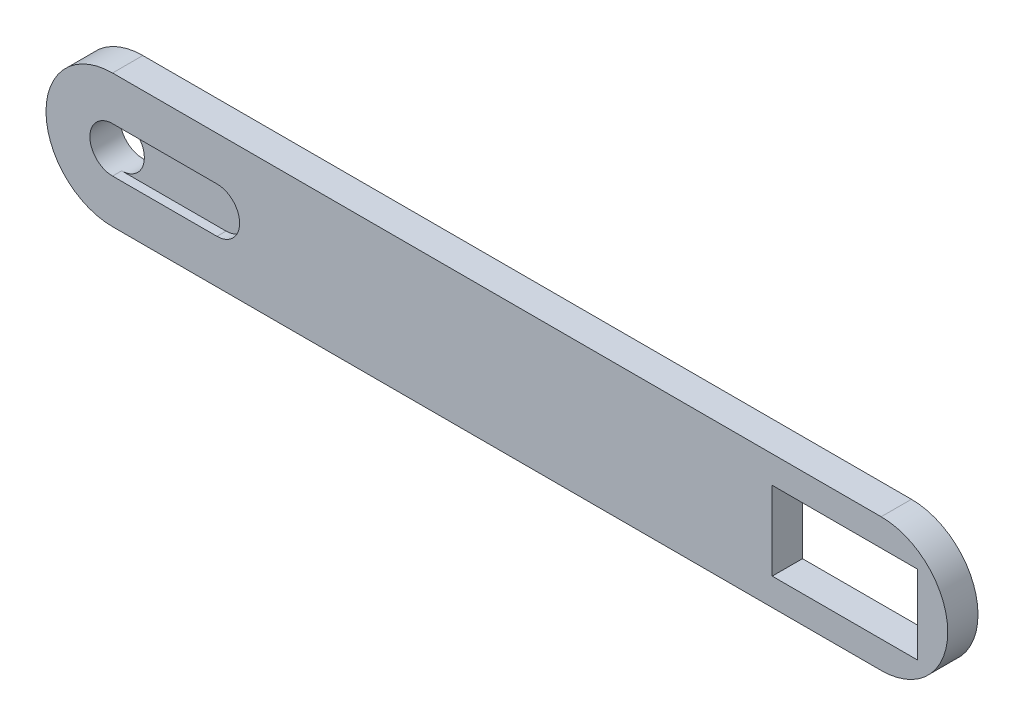
ISO-10303-21;
HEADER;
FILE_DESCRIPTION(('STEP AP214'),'2;1');
FILE_NAME('part.step','',(''),(''),'','','');
FILE_SCHEMA(('AUTOMOTIVE_DESIGN { 1 0 10303 214 1 1 1 1 }'));
ENDSEC;
DATA;
#1=APPLICATION_CONTEXT('core data for automotive mechanical design processes');
#2=APPLICATION_PROTOCOL_DEFINITION('international standard','automotive_design',2000,#1);
#3=PRODUCT_CONTEXT('',#1,'mechanical');
#4=PRODUCT('Part','Part','',(#3));
#5=PRODUCT_RELATED_PRODUCT_CATEGORY('part','',(#4));
#6=PRODUCT_DEFINITION_FORMATION('','',#4);
#7=PRODUCT_DEFINITION_CONTEXT('part definition',#1,'design');
#8=PRODUCT_DEFINITION('design','',#6,#7);
#9=PRODUCT_DEFINITION_SHAPE('','',#8);
#10=(LENGTH_UNIT() NAMED_UNIT(*) SI_UNIT(.MILLI.,.METRE.));
#11=(NAMED_UNIT(*) PLANE_ANGLE_UNIT() SI_UNIT($,.RADIAN.));
#12=(NAMED_UNIT(*) SI_UNIT($,.STERADIAN.) SOLID_ANGLE_UNIT());
#13=UNCERTAINTY_MEASURE_WITH_UNIT(LENGTH_MEASURE(1.E-05),#10,'distance_accuracy_value','');
#14=(GEOMETRIC_REPRESENTATION_CONTEXT(3) GLOBAL_UNCERTAINTY_ASSIGNED_CONTEXT((#13)) GLOBAL_UNIT_ASSIGNED_CONTEXT((#10,
#11,#12)) REPRESENTATION_CONTEXT('',''));
#15=CARTESIAN_POINT('',(0.,0.,0.));
#16=DIRECTION('',(0.,0.,1.));
#17=DIRECTION('',(1.,0.,0.));
#18=AXIS2_PLACEMENT_3D('',#15,#16,#17);
#19=CARTESIAN_POINT('',(0.,11.,5.));
#20=DIRECTION('',(0.,0.,-1.));
#21=DIRECTION('',(-1.,0.,0.));
#22=AXIS2_PLACEMENT_3D('',#19,#20,#21);
#23=CYLINDRICAL_SURFACE('',#22,3.75);
#24=CARTESIAN_POINT('',(0.,11.,0.));
#25=DIRECTION('',(0.,0.,1.));
#26=DIRECTION('',(1.,0.,0.));
#27=AXIS2_PLACEMENT_3D('',#24,#25,#26);
#28=CIRCLE('',#27,3.75);
#29=CARTESIAN_POINT('',(3.75,11.,0.));
#30=VERTEX_POINT('',#29);
#31=EDGE_CURVE('E141',#30,#30,#28,.T.);
#32=ORIENTED_EDGE('',*,*,#31,.F.);
#33=EDGE_LOOP('',(#32));
#34=FACE_BOUND('',#33,.T.);
#35=CARTESIAN_POINT('',(0.,11.,5.));
#36=DIRECTION('',(0.,0.,1.));
#37=DIRECTION('',(1.,0.,0.));
#38=AXIS2_PLACEMENT_3D('',#35,#36,#37);
#39=CIRCLE('',#38,3.75);
#40=CARTESIAN_POINT('',(0.,14.75,5.));
#41=VERTEX_POINT('',#40);
#42=CARTESIAN_POINT('',(0.,7.24999999999999,5.));
#43=VERTEX_POINT('',#42);
#44=EDGE_CURVE('E164',#41,#43,#39,.T.);
#45=ORIENTED_EDGE('',*,*,#44,.T.);
#46=DIRECTION('',(0.,0.,1.));
#47=VECTOR('',#46,1.);
#48=CARTESIAN_POINT('',(0.,7.24999999999999,3.5));
#49=LINE('',#48,#47);
#50=CARTESIAN_POINT('',(0.,7.24999999999999,3.5));
#51=VERTEX_POINT('',#50);
#52=EDGE_CURVE('E218',#51,#43,#49,.T.);
#53=ORIENTED_EDGE('',*,*,#52,.F.);
#54=CARTESIAN_POINT('',(0.,11.,3.5));
#55=DIRECTION('',(0.,0.,-1.));
#56=DIRECTION('',(-1.,0.,0.));
#57=AXIS2_PLACEMENT_3D('',#54,#55,#56);
#58=CIRCLE('',#57,3.75);
#59=CARTESIAN_POINT('',(0.,14.75,3.5));
#60=VERTEX_POINT('',#59);
#61=EDGE_CURVE('E354',#60,#51,#58,.T.);
#62=ORIENTED_EDGE('',*,*,#61,.F.);
#63=DIRECTION('',(0.,0.,1.));
#64=VECTOR('',#63,1.);
#65=CARTESIAN_POINT('',(0.,14.75,3.5));
#66=LINE('',#65,#64);
#67=EDGE_CURVE('E221',#60,#41,#66,.T.);
#68=ORIENTED_EDGE('',*,*,#67,.T.);
#69=EDGE_LOOP('',(#45,#53,#62,#68));
#70=FACE_BOUND('',#69,.T.);
#71=ADVANCED_FACE('F34',(#34,#70),#23,.F.);
#72=CARTESIAN_POINT('',(0.,22.,5.));
#73=DIRECTION('',(0.,-1.,0.));
#74=DIRECTION('',(1.,0.,0.));
#75=AXIS2_PLACEMENT_3D('',#72,#73,#74);
#76=PLANE('',#75);
#77=DIRECTION('',(-1.,0.,0.));
#78=VECTOR('',#77,1.);
#79=CARTESIAN_POINT('',(0.,22.,0.));
#80=LINE('',#79,#78);
#81=CARTESIAN_POINT('',(127.,22.,0.));
#82=VERTEX_POINT('',#81);
#83=CARTESIAN_POINT('',(0.,22.,0.));
#84=VERTEX_POINT('',#83);
#85=EDGE_CURVE('E157',#82,#84,#80,.T.);
#86=ORIENTED_EDGE('',*,*,#85,.T.);
#87=DIRECTION('',(0.,0.,-1.));
#88=VECTOR('',#87,1.);
#89=CARTESIAN_POINT('',(0.,22.,5.));
#90=LINE('',#89,#88);
#91=CARTESIAN_POINT('',(0.,22.,5.));
#92=VERTEX_POINT('',#91);
#93=EDGE_CURVE('E11',#92,#84,#90,.T.);
#94=ORIENTED_EDGE('',*,*,#93,.F.);
#95=DIRECTION('',(-1.,0.,0.));
#96=VECTOR('',#95,1.);
#97=CARTESIAN_POINT('',(0.,22.,5.));
#98=LINE('',#97,#96);
#99=CARTESIAN_POINT('',(127.,22.,5.));
#100=VERTEX_POINT('',#99);
#101=EDGE_CURVE('E124',#100,#92,#98,.T.);
#102=ORIENTED_EDGE('',*,*,#101,.F.);
#103=DIRECTION('',(0.,0.,-1.));
#104=VECTOR('',#103,1.);
#105=CARTESIAN_POINT('',(127.,22.,5.));
#106=LINE('',#105,#104);
#107=EDGE_CURVE('E165',#100,#82,#106,.T.);
#108=ORIENTED_EDGE('',*,*,#107,.T.);
#109=EDGE_LOOP('',(#86,#94,#102,#108));
#110=FACE_BOUND('',#109,.T.);
#111=ADVANCED_FACE('F201',(#110),#76,.F.);
#112=CARTESIAN_POINT('',(0.,11.,5.));
#113=DIRECTION('',(0.,0.,-1.));
#114=DIRECTION('',(-1.,0.,0.));
#115=AXIS2_PLACEMENT_3D('',#112,#113,#114);
#116=CYLINDRICAL_SURFACE('',#115,11.);
#117=CARTESIAN_POINT('',(0.,11.,0.));
#118=DIRECTION('',(0.,0.,1.));
#119=DIRECTION('',(1.,0.,0.));
#120=AXIS2_PLACEMENT_3D('',#117,#118,#119);
#121=CIRCLE('',#120,11.);
#122=CARTESIAN_POINT('',(0.,0.,0.));
#123=VERTEX_POINT('',#122);
#124=EDGE_CURVE('E130',#84,#123,#121,.T.);
#125=ORIENTED_EDGE('',*,*,#124,.T.);
#126=DIRECTION('',(0.,0.,-1.));
#127=VECTOR('',#126,1.);
#128=CARTESIAN_POINT('',(0.,0.,5.));
#129=LINE('',#128,#127);
#130=CARTESIAN_POINT('',(0.,0.,5.));
#131=VERTEX_POINT('',#130);
#132=EDGE_CURVE('E42',#131,#123,#129,.T.);
#133=ORIENTED_EDGE('',*,*,#132,.F.);
#134=CARTESIAN_POINT('',(0.,11.,5.));
#135=DIRECTION('',(0.,0.,1.));
#136=DIRECTION('',(1.,0.,0.));
#137=AXIS2_PLACEMENT_3D('',#134,#135,#136);
#138=CIRCLE('',#137,11.);
#139=EDGE_CURVE('E117',#92,#131,#138,.T.);
#140=ORIENTED_EDGE('',*,*,#139,.F.);
#141=ORIENTED_EDGE('',*,*,#93,.T.);
#142=EDGE_LOOP('',(#125,#133,#140,#141));
#143=FACE_BOUND('',#142,.T.);
#144=ADVANCED_FACE('F129',(#143),#116,.T.);
#145=CARTESIAN_POINT('',(0.,0.,5.));
#146=DIRECTION('',(0.,1.,0.));
#147=DIRECTION('',(0.,0.,1.));
#148=AXIS2_PLACEMENT_3D('',#145,#146,#147);
#149=PLANE('',#148);
#150=DIRECTION('',(1.,0.,0.));
#151=VECTOR('',#150,1.);
#152=CARTESIAN_POINT('',(0.,0.,0.));
#153=LINE('',#152,#151);
#154=CARTESIAN_POINT('',(127.,0.,0.));
#155=VERTEX_POINT('',#154);
#156=EDGE_CURVE('E161',#123,#155,#153,.T.);
#157=ORIENTED_EDGE('',*,*,#156,.T.);
#158=DIRECTION('',(0.,0.,-1.));
#159=VECTOR('',#158,1.);
#160=CARTESIAN_POINT('',(127.,0.,5.));
#161=LINE('',#160,#159);
#162=CARTESIAN_POINT('',(127.,0.,5.));
#163=VERTEX_POINT('',#162);
#164=EDGE_CURVE('E133',#163,#155,#161,.T.);
#165=ORIENTED_EDGE('',*,*,#164,.F.);
#166=DIRECTION('',(1.,0.,0.));
#167=VECTOR('',#166,1.);
#168=CARTESIAN_POINT('',(0.,0.,5.));
#169=LINE('',#168,#167);
#170=EDGE_CURVE('E121',#131,#163,#169,.T.);
#171=ORIENTED_EDGE('',*,*,#170,.F.);
#172=ORIENTED_EDGE('',*,*,#132,.T.);
#173=EDGE_LOOP('',(#157,#165,#171,#172));
#174=FACE_BOUND('',#173,.T.);
#175=ADVANCED_FACE('F135',(#174),#149,.F.);
#176=CARTESIAN_POINT('',(0.,17.5,5.));
#177=DIRECTION('',(0.,1.,0.));
#178=DIRECTION('',(0.,0.,1.));
#179=AXIS2_PLACEMENT_3D('',#176,#177,#178);
#180=PLANE('',#179);
#181=DIRECTION('',(1.,0.,0.));
#182=VECTOR('',#181,1.);
#183=CARTESIAN_POINT('',(0.,17.5,0.));
#184=LINE('',#183,#182);
#185=CARTESIAN_POINT('',(109.,17.5,0.));
#186=VERTEX_POINT('',#185);
#187=CARTESIAN_POINT('',(133.,17.5,0.));
#188=VERTEX_POINT('',#187);
#189=EDGE_CURVE('E144',#186,#188,#184,.T.);
#190=ORIENTED_EDGE('',*,*,#189,.T.);
#191=DIRECTION('',(0.,0.,-1.));
#192=VECTOR('',#191,1.);
#193=CARTESIAN_POINT('',(133.,17.5,5.));
#194=LINE('',#193,#192);
#195=CARTESIAN_POINT('',(133.,17.5,5.));
#196=VERTEX_POINT('',#195);
#197=EDGE_CURVE('E37',#196,#188,#194,.T.);
#198=ORIENTED_EDGE('',*,*,#197,.F.);
#199=DIRECTION('',(1.,0.,0.));
#200=VECTOR('',#199,1.);
#201=CARTESIAN_POINT('',(0.,17.5,5.));
#202=LINE('',#201,#200);
#203=CARTESIAN_POINT('',(109.,17.5,5.));
#204=VERTEX_POINT('',#203);
#205=EDGE_CURVE('E225',#204,#196,#202,.T.);
#206=ORIENTED_EDGE('',*,*,#205,.F.);
#207=DIRECTION('',(0.,0.,-1.));
#208=VECTOR('',#207,1.);
#209=CARTESIAN_POINT('',(109.,17.5,5.));
#210=LINE('',#209,#208);
#211=EDGE_CURVE('E137',#204,#186,#210,.T.);
#212=ORIENTED_EDGE('',*,*,#211,.T.);
#213=EDGE_LOOP('',(#190,#198,#206,#212));
#214=FACE_BOUND('',#213,.T.);
#215=ADVANCED_FACE('F179',(#214),#180,.F.);
#216=CARTESIAN_POINT('',(133.,0.,5.));
#217=DIRECTION('',(1.,0.,0.));
#218=DIRECTION('',(0.,0.,-1.));
#219=AXIS2_PLACEMENT_3D('',#216,#217,#218);
#220=PLANE('',#219);
#221=DIRECTION('',(0.,-1.,0.));
#222=VECTOR('',#221,1.);
#223=CARTESIAN_POINT('',(133.,0.,0.));
#224=LINE('',#223,#222);
#225=CARTESIAN_POINT('',(133.,4.5,0.));
#226=VERTEX_POINT('',#225);
#227=EDGE_CURVE('E148',#188,#226,#224,.T.);
#228=ORIENTED_EDGE('',*,*,#227,.T.);
#229=DIRECTION('',(0.,0.,-1.));
#230=VECTOR('',#229,1.);
#231=CARTESIAN_POINT('',(133.,4.5,5.));
#232=LINE('',#231,#230);
#233=CARTESIAN_POINT('',(133.,4.5,5.));
#234=VERTEX_POINT('',#233);
#235=EDGE_CURVE('E170',#234,#226,#232,.T.);
#236=ORIENTED_EDGE('',*,*,#235,.F.);
#237=DIRECTION('',(0.,-1.,0.));
#238=VECTOR('',#237,1.);
#239=CARTESIAN_POINT('',(133.,0.,5.));
#240=LINE('',#239,#238);
#241=EDGE_CURVE('E101',#196,#234,#240,.T.);
#242=ORIENTED_EDGE('',*,*,#241,.F.);
#243=ORIENTED_EDGE('',*,*,#197,.T.);
#244=EDGE_LOOP('',(#228,#236,#242,#243));
#245=FACE_BOUND('',#244,.T.);
#246=ADVANCED_FACE('F175',(#245),#220,.F.);
#247=CARTESIAN_POINT('',(0.,4.5,5.));
#248=DIRECTION('',(0.,1.,0.));
#249=DIRECTION('',(0.,0.,1.));
#250=AXIS2_PLACEMENT_3D('',#247,#248,#249);
#251=PLANE('',#250);
#252=DIRECTION('',(1.,0.,0.));
#253=VECTOR('',#252,1.);
#254=CARTESIAN_POINT('',(0.,4.5,0.));
#255=LINE('',#254,#253);
#256=CARTESIAN_POINT('',(109.,4.5,0.));
#257=VERTEX_POINT('',#256);
#258=EDGE_CURVE('E151',#257,#226,#255,.T.);
#259=ORIENTED_EDGE('',*,*,#258,.F.);
#260=DIRECTION('',(0.,0.,-1.));
#261=VECTOR('',#260,1.);
#262=CARTESIAN_POINT('',(109.,4.5,5.));
#263=LINE('',#262,#261);
#264=CARTESIAN_POINT('',(109.,4.5,5.));
#265=VERTEX_POINT('',#264);
#266=EDGE_CURVE('E169',#265,#257,#263,.T.);
#267=ORIENTED_EDGE('',*,*,#266,.F.);
#268=DIRECTION('',(1.,0.,0.));
#269=VECTOR('',#268,1.);
#270=CARTESIAN_POINT('',(0.,4.5,5.));
#271=LINE('',#270,#269);
#272=EDGE_CURVE('E233',#265,#234,#271,.T.);
#273=ORIENTED_EDGE('',*,*,#272,.T.);
#274=ORIENTED_EDGE('',*,*,#235,.T.);
#275=EDGE_LOOP('',(#259,#267,#273,#274));
#276=FACE_BOUND('',#275,.T.);
#277=ADVANCED_FACE('F190',(#276),#251,.T.);
#278=CARTESIAN_POINT('',(109.,0.,5.));
#279=DIRECTION('',(1.,0.,0.));
#280=DIRECTION('',(0.,0.,-1.));
#281=AXIS2_PLACEMENT_3D('',#278,#279,#280);
#282=PLANE('',#281);
#283=DIRECTION('',(0.,-1.,0.));
#284=VECTOR('',#283,1.);
#285=CARTESIAN_POINT('',(109.,0.,0.));
#286=LINE('',#285,#284);
#287=EDGE_CURVE('E154',#186,#257,#286,.T.);
#288=ORIENTED_EDGE('',*,*,#287,.F.);
#289=ORIENTED_EDGE('',*,*,#211,.F.);
#290=DIRECTION('',(0.,-1.,0.));
#291=VECTOR('',#290,1.);
#292=CARTESIAN_POINT('',(109.,0.,5.));
#293=LINE('',#292,#291);
#294=EDGE_CURVE('E188',#204,#265,#293,.T.);
#295=ORIENTED_EDGE('',*,*,#294,.T.);
#296=ORIENTED_EDGE('',*,*,#266,.T.);
#297=EDGE_LOOP('',(#288,#289,#295,#296));
#298=FACE_BOUND('',#297,.T.);
#299=ADVANCED_FACE('F185',(#298),#282,.T.);
#300=CARTESIAN_POINT('',(127.,11.,5.));
#301=DIRECTION('',(0.,0.,-1.));
#302=DIRECTION('',(-1.,0.,0.));
#303=AXIS2_PLACEMENT_3D('',#300,#301,#302);
#304=CYLINDRICAL_SURFACE('',#303,11.);
#305=CARTESIAN_POINT('',(127.,11.,0.));
#306=DIRECTION('',(0.,0.,1.));
#307=DIRECTION('',(1.,0.,0.));
#308=AXIS2_PLACEMENT_3D('',#305,#306,#307);
#309=CIRCLE('',#308,11.);
#310=EDGE_CURVE('E92',#155,#82,#309,.T.);
#311=ORIENTED_EDGE('',*,*,#310,.T.);
#312=ORIENTED_EDGE('',*,*,#107,.F.);
#313=CARTESIAN_POINT('',(127.,11.,5.));
#314=DIRECTION('',(0.,0.,1.));
#315=DIRECTION('',(1.,0.,0.));
#316=AXIS2_PLACEMENT_3D('',#313,#314,#315);
#317=CIRCLE('',#316,11.);
#318=EDGE_CURVE('E59',#163,#100,#317,.T.);
#319=ORIENTED_EDGE('',*,*,#318,.F.);
#320=ORIENTED_EDGE('',*,*,#164,.T.);
#321=EDGE_LOOP('',(#311,#312,#319,#320));
#322=FACE_BOUND('',#321,.T.);
#323=ADVANCED_FACE('F197',(#322),#304,.T.);
#324=CARTESIAN_POINT('',(0.,0.,5.));
#325=DIRECTION('',(0.,0.,1.));
#326=DIRECTION('',(1.,0.,0.));
#327=AXIS2_PLACEMENT_3D('',#324,#325,#326);
#328=PLANE('',#327);
#329=DIRECTION('',(1.,0.,0.));
#330=VECTOR('',#329,1.);
#331=CARTESIAN_POINT('',(0.,7.24999999999999,5.));
#332=LINE('',#331,#330);
#333=CARTESIAN_POINT('',(17.25,7.24999999999999,5.));
#334=VERTEX_POINT('',#333);
#335=EDGE_CURVE('E352',#43,#334,#332,.T.);
#336=ORIENTED_EDGE('',*,*,#335,.F.);
#337=ORIENTED_EDGE('',*,*,#44,.F.);
#338=DIRECTION('',(-1.,0.,0.));
#339=VECTOR('',#338,1.);
#340=CARTESIAN_POINT('',(0.,14.75,5.));
#341=LINE('',#340,#339);
#342=CARTESIAN_POINT('',(17.25,14.75,5.));
#343=VERTEX_POINT('',#342);
#344=EDGE_CURVE('E357',#343,#41,#341,.T.);
#345=ORIENTED_EDGE('',*,*,#344,.F.);
#346=CARTESIAN_POINT('',(17.25,11.,5.));
#347=DIRECTION('',(0.,0.,1.));
#348=DIRECTION('',(-1.,0.,0.));
#349=AXIS2_PLACEMENT_3D('',#346,#347,#348);
#350=CIRCLE('',#349,3.75);
#351=EDGE_CURVE('E50',#334,#343,#350,.T.);
#352=ORIENTED_EDGE('',*,*,#351,.F.);
#353=EDGE_LOOP('',(#336,#337,#345,#352));
#354=FACE_BOUND('',#353,.T.);
#355=ORIENTED_EDGE('',*,*,#205,.T.);
#356=ORIENTED_EDGE('',*,*,#241,.T.);
#357=ORIENTED_EDGE('',*,*,#272,.F.);
#358=ORIENTED_EDGE('',*,*,#294,.F.);
#359=EDGE_LOOP('',(#355,#356,#357,#358));
#360=FACE_BOUND('',#359,.T.);
#361=ORIENTED_EDGE('',*,*,#101,.T.);
#362=ORIENTED_EDGE('',*,*,#139,.T.);
#363=ORIENTED_EDGE('',*,*,#170,.T.);
#364=ORIENTED_EDGE('',*,*,#318,.T.);
#365=EDGE_LOOP('',(#361,#362,#363,#364));
#366=FACE_BOUND('',#365,.T.);
#367=ADVANCED_FACE('F119',(#354,#360,#366),#328,.T.);
#368=CARTESIAN_POINT('',(0.,0.,0.));
#369=DIRECTION('',(0.,0.,1.));
#370=DIRECTION('',(1.,0.,0.));
#371=AXIS2_PLACEMENT_3D('',#368,#369,#370);
#372=PLANE('',#371);
#373=ORIENTED_EDGE('',*,*,#31,.T.);
#374=EDGE_LOOP('',(#373));
#375=FACE_BOUND('',#374,.T.);
#376=ORIENTED_EDGE('',*,*,#189,.F.);
#377=ORIENTED_EDGE('',*,*,#287,.T.);
#378=ORIENTED_EDGE('',*,*,#258,.T.);
#379=ORIENTED_EDGE('',*,*,#227,.F.);
#380=EDGE_LOOP('',(#376,#377,#378,#379));
#381=FACE_BOUND('',#380,.T.);
#382=ORIENTED_EDGE('',*,*,#85,.F.);
#383=ORIENTED_EDGE('',*,*,#310,.F.);
#384=ORIENTED_EDGE('',*,*,#156,.F.);
#385=ORIENTED_EDGE('',*,*,#124,.F.);
#386=EDGE_LOOP('',(#382,#383,#384,#385));
#387=FACE_BOUND('',#386,.T.);
#388=ADVANCED_FACE('F182',(#375,#381,#387),#372,.F.);
#389=CARTESIAN_POINT('',(17.25,11.,3.5));
#390=DIRECTION('',(0.,0.,1.));
#391=DIRECTION('',(1.,0.,0.));
#392=AXIS2_PLACEMENT_3D('',#389,#390,#391);
#393=CYLINDRICAL_SURFACE('',#392,3.75);
#394=ORIENTED_EDGE('',*,*,#351,.T.);
#395=DIRECTION('',(0.,0.,1.));
#396=VECTOR('',#395,1.);
#397=CARTESIAN_POINT('',(17.25,14.75,3.5));
#398=LINE('',#397,#396);
#399=CARTESIAN_POINT('',(17.25,14.75,3.5));
#400=VERTEX_POINT('',#399);
#401=EDGE_CURVE('E229',#400,#343,#398,.T.);
#402=ORIENTED_EDGE('',*,*,#401,.F.);
#403=CARTESIAN_POINT('',(17.25,11.,3.5));
#404=DIRECTION('',(0.,0.,1.));
#405=DIRECTION('',(-1.,0.,0.));
#406=AXIS2_PLACEMENT_3D('',#403,#404,#405);
#407=CIRCLE('',#406,3.75);
#408=CARTESIAN_POINT('',(17.25,7.24999999999999,3.5));
#409=VERTEX_POINT('',#408);
#410=EDGE_CURVE('E344',#409,#400,#407,.T.);
#411=ORIENTED_EDGE('',*,*,#410,.F.);
#412=DIRECTION('',(0.,0.,1.));
#413=VECTOR('',#412,1.);
#414=CARTESIAN_POINT('',(17.25,7.24999999999999,3.5));
#415=LINE('',#414,#413);
#416=EDGE_CURVE('E145',#409,#334,#415,.T.);
#417=ORIENTED_EDGE('',*,*,#416,.T.);
#418=EDGE_LOOP('',(#394,#402,#411,#417));
#419=FACE_BOUND('',#418,.T.);
#420=ADVANCED_FACE('F242',(#419),#393,.F.);
#421=CARTESIAN_POINT('',(0.,7.24999999999999,3.5));
#422=DIRECTION('',(0.,-1.,0.));
#423=DIRECTION('',(0.,0.,-1.));
#424=AXIS2_PLACEMENT_3D('',#421,#422,#423);
#425=PLANE('',#424);
#426=ORIENTED_EDGE('',*,*,#335,.T.);
#427=ORIENTED_EDGE('',*,*,#416,.F.);
#428=DIRECTION('',(1.,0.,0.));
#429=VECTOR('',#428,1.);
#430=CARTESIAN_POINT('',(0.,7.24999999999999,3.5));
#431=LINE('',#430,#429);
#432=EDGE_CURVE('E350',#51,#409,#431,.T.);
#433=ORIENTED_EDGE('',*,*,#432,.F.);
#434=ORIENTED_EDGE('',*,*,#52,.T.);
#435=EDGE_LOOP('',(#426,#427,#433,#434));
#436=FACE_BOUND('',#435,.T.);
#437=ADVANCED_FACE('F308',(#436),#425,.F.);
#438=CARTESIAN_POINT('',(0.,14.75,3.5));
#439=DIRECTION('',(0.,1.,0.));
#440=DIRECTION('',(0.,0.,1.));
#441=AXIS2_PLACEMENT_3D('',#438,#439,#440);
#442=PLANE('',#441);
#443=ORIENTED_EDGE('',*,*,#344,.T.);
#444=ORIENTED_EDGE('',*,*,#67,.F.);
#445=DIRECTION('',(-1.,0.,0.));
#446=VECTOR('',#445,1.);
#447=CARTESIAN_POINT('',(0.,14.75,3.5));
#448=LINE('',#447,#446);
#449=EDGE_CURVE('E348',#400,#60,#448,.T.);
#450=ORIENTED_EDGE('',*,*,#449,.F.);
#451=ORIENTED_EDGE('',*,*,#401,.T.);
#452=EDGE_LOOP('',(#443,#444,#450,#451));
#453=FACE_BOUND('',#452,.T.);
#454=ADVANCED_FACE('F316',(#453),#442,.F.);
#455=CARTESIAN_POINT('',(17.25,11.,3.5));
#456=DIRECTION('',(0.,0.,-1.));
#457=DIRECTION('',(-1.,0.,0.));
#458=AXIS2_PLACEMENT_3D('',#455,#456,#457);
#459=PLANE('',#458);
#460=ORIENTED_EDGE('',*,*,#410,.T.);
#461=ORIENTED_EDGE('',*,*,#449,.T.);
#462=ORIENTED_EDGE('',*,*,#61,.T.);
#463=ORIENTED_EDGE('',*,*,#432,.T.);
#464=EDGE_LOOP('',(#460,#461,#462,#463));
#465=FACE_BOUND('',#464,.T.);
#466=ADVANCED_FACE('F326',(#465),#459,.F.);
#467=CLOSED_SHELL('',(#71,#111,#144,#175,#215,#246,#277,#299,#323,#367,#388,#420,#437,#454,#466));
#468=MANIFOLD_SOLID_BREP('B2',#467);
#469=ADVANCED_BREP_SHAPE_REPRESENTATION('',(#18,#468),#14);
#470=SHAPE_DEFINITION_REPRESENTATION(#9,#469);
ENDSEC;
END-ISO-10303-21;
